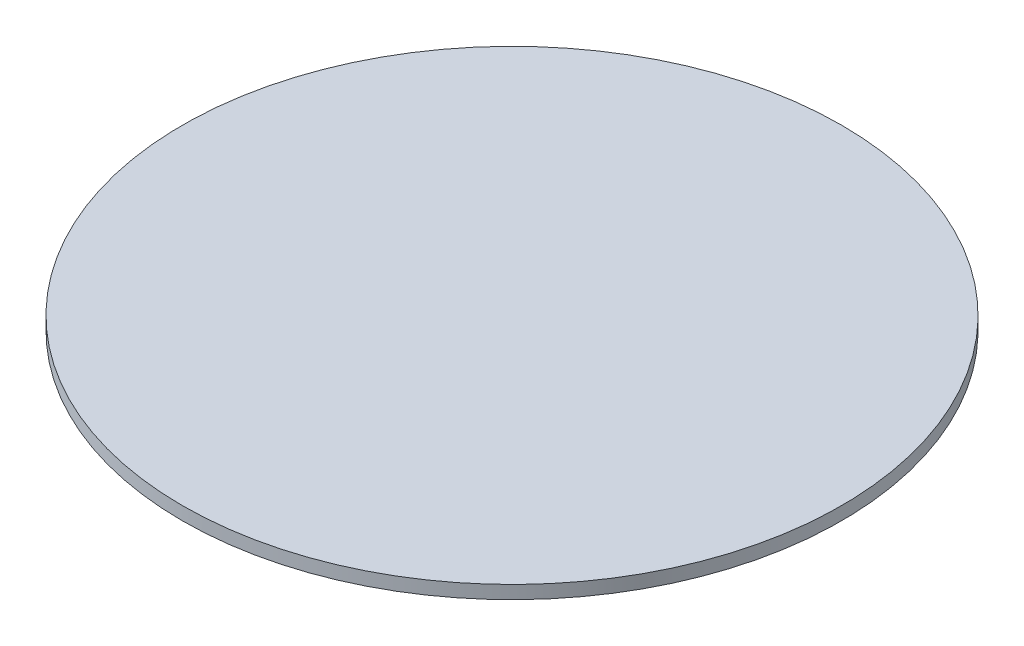
ISO-10303-21;
HEADER;
FILE_DESCRIPTION(('STEP AP214'),'2;1');
FILE_NAME('part.step','',(''),(''),'','','');
FILE_SCHEMA(('AUTOMOTIVE_DESIGN { 1 0 10303 214 1 1 1 1 }'));
ENDSEC;
DATA;
#1=APPLICATION_CONTEXT('core data for automotive mechanical design processes');
#2=APPLICATION_PROTOCOL_DEFINITION('international standard','automotive_design',2000,#1);
#3=PRODUCT_CONTEXT('',#1,'mechanical');
#4=PRODUCT('Part','Part','',(#3));
#5=PRODUCT_RELATED_PRODUCT_CATEGORY('part','',(#4));
#6=PRODUCT_DEFINITION_FORMATION('','',#4);
#7=PRODUCT_DEFINITION_CONTEXT('part definition',#1,'design');
#8=PRODUCT_DEFINITION('design','',#6,#7);
#9=PRODUCT_DEFINITION_SHAPE('','',#8);
#10=(LENGTH_UNIT() NAMED_UNIT(*) SI_UNIT(.MILLI.,.METRE.));
#11=(NAMED_UNIT(*) PLANE_ANGLE_UNIT() SI_UNIT($,.RADIAN.));
#12=(NAMED_UNIT(*) SI_UNIT($,.STERADIAN.) SOLID_ANGLE_UNIT());
#13=UNCERTAINTY_MEASURE_WITH_UNIT(LENGTH_MEASURE(1.E-05),#10,'distance_accuracy_value','');
#14=(GEOMETRIC_REPRESENTATION_CONTEXT(3) GLOBAL_UNCERTAINTY_ASSIGNED_CONTEXT((#13)) GLOBAL_UNIT_ASSIGNED_CONTEXT((#10,
#11,#12)) REPRESENTATION_CONTEXT('',''));
#15=CARTESIAN_POINT('',(0.,0.,0.));
#16=DIRECTION('',(0.,0.,1.));
#17=DIRECTION('',(1.,0.,0.));
#18=AXIS2_PLACEMENT_3D('',#15,#16,#17);
#19=CARTESIAN_POINT('',(0.,40.,0.));
#20=DIRECTION('',(0.,-1.,0.));
#21=DIRECTION('',(0.,0.,-1.));
#22=AXIS2_PLACEMENT_3D('',#19,#20,#21);
#23=CYLINDRICAL_SURFACE('',#22,1000.);
#24=CARTESIAN_POINT('',(0.,40.,0.));
#25=DIRECTION('',(0.,1.,0.));
#26=DIRECTION('',(0.,0.,1.));
#27=AXIS2_PLACEMENT_3D('',#24,#25,#26);
#28=CIRCLE('',#27,1000.);
#29=CARTESIAN_POINT('',(0.,40.,1000.));
#30=VERTEX_POINT('',#29);
#31=EDGE_CURVE('E10',#30,#30,#28,.T.);
#32=ORIENTED_EDGE('',*,*,#31,.F.);
#33=EDGE_LOOP('',(#32));
#34=FACE_BOUND('',#33,.T.);
#35=CARTESIAN_POINT('',(0.,0.,0.));
#36=DIRECTION('',(0.,1.,0.));
#37=DIRECTION('',(0.,0.,1.));
#38=AXIS2_PLACEMENT_3D('',#35,#36,#37);
#39=CIRCLE('',#38,1000.);
#40=CARTESIAN_POINT('',(0.,0.,1000.));
#41=VERTEX_POINT('',#40);
#42=EDGE_CURVE('E36',#41,#41,#39,.T.);
#43=ORIENTED_EDGE('',*,*,#42,.T.);
#44=EDGE_LOOP('',(#43));
#45=FACE_BOUND('',#44,.T.);
#46=ADVANCED_FACE('F33',(#34,#45),#23,.T.);
#47=CARTESIAN_POINT('',(0.,40.,0.));
#48=DIRECTION('',(0.,1.,0.));
#49=DIRECTION('',(0.,0.,1.));
#50=AXIS2_PLACEMENT_3D('',#47,#48,#49);
#51=PLANE('',#50);
#52=ORIENTED_EDGE('',*,*,#31,.T.);
#53=EDGE_LOOP('',(#52));
#54=FACE_BOUND('',#53,.T.);
#55=ADVANCED_FACE('F48',(#54),#51,.T.);
#56=CARTESIAN_POINT('',(0.,0.,0.));
#57=DIRECTION('',(0.,1.,0.));
#58=DIRECTION('',(0.,0.,1.));
#59=AXIS2_PLACEMENT_3D('',#56,#57,#58);
#60=PLANE('',#59);
#61=ORIENTED_EDGE('',*,*,#42,.F.);
#62=EDGE_LOOP('',(#61));
#63=FACE_BOUND('',#62,.T.);
#64=ADVANCED_FACE('F46',(#63),#60,.F.);
#65=CLOSED_SHELL('',(#46,#55,#64));
#66=MANIFOLD_SOLID_BREP('B2',#65);
#67=ADVANCED_BREP_SHAPE_REPRESENTATION('',(#18,#66),#14);
#68=SHAPE_DEFINITION_REPRESENTATION(#9,#67);
ENDSEC;
END-ISO-10303-21;
